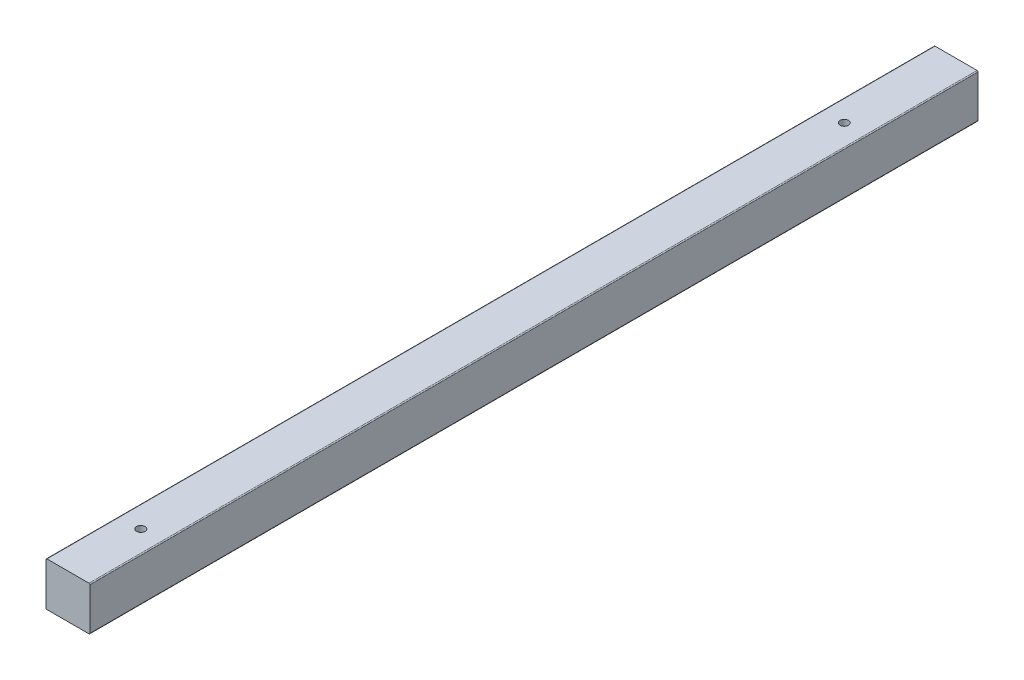
ISO-10303-21;
HEADER;
FILE_DESCRIPTION(('STEP AP214'),'2;1');
FILE_NAME('part.step','',(''),(''),'','','');
FILE_SCHEMA(('AUTOMOTIVE_DESIGN { 1 0 10303 214 1 1 1 1 }'));
ENDSEC;
DATA;
#1=APPLICATION_CONTEXT('core data for automotive mechanical design processes');
#2=APPLICATION_PROTOCOL_DEFINITION('international standard','automotive_design',2000,#1);
#3=PRODUCT_CONTEXT('',#1,'mechanical');
#4=PRODUCT('Part','Part','',(#3));
#5=PRODUCT_RELATED_PRODUCT_CATEGORY('part','',(#4));
#6=PRODUCT_DEFINITION_FORMATION('','',#4);
#7=PRODUCT_DEFINITION_CONTEXT('part definition',#1,'design');
#8=PRODUCT_DEFINITION('design','',#6,#7);
#9=PRODUCT_DEFINITION_SHAPE('','',#8);
#10=(LENGTH_UNIT() NAMED_UNIT(*) SI_UNIT(.MILLI.,.METRE.));
#11=(NAMED_UNIT(*) PLANE_ANGLE_UNIT() SI_UNIT($,.RADIAN.));
#12=(NAMED_UNIT(*) SI_UNIT($,.STERADIAN.) SOLID_ANGLE_UNIT());
#13=UNCERTAINTY_MEASURE_WITH_UNIT(LENGTH_MEASURE(1.E-05),#10,'distance_accuracy_value','');
#14=(GEOMETRIC_REPRESENTATION_CONTEXT(3) GLOBAL_UNCERTAINTY_ASSIGNED_CONTEXT((#13)) GLOBAL_UNIT_ASSIGNED_CONTEXT((#10,
#11,#12)) REPRESENTATION_CONTEXT('',''));
#15=CARTESIAN_POINT('',(0.,0.,0.));
#16=DIRECTION('',(0.,0.,1.));
#17=DIRECTION('',(1.,0.,0.));
#18=AXIS2_PLACEMENT_3D('',#15,#16,#17);
#19=CARTESIAN_POINT('',(0.,0.,890.));
#20=DIRECTION('',(-1.,0.,0.));
#21=DIRECTION('',(0.,0.,1.));
#22=AXIS2_PLACEMENT_3D('',#19,#20,#21);
#23=PLANE('',#22);
#24=DIRECTION('',(0.,1.,0.));
#25=VECTOR('',#24,1.);
#26=CARTESIAN_POINT('',(0.,0.,0.));
#27=LINE('',#26,#25);
#28=CARTESIAN_POINT('',(0.,1.,0.));
#29=VERTEX_POINT('',#28);
#30=CARTESIAN_POINT('',(0.,43.,0.));
#31=VERTEX_POINT('',#30);
#32=EDGE_CURVE('E136',#29,#31,#27,.T.);
#33=ORIENTED_EDGE('',*,*,#32,.T.);
#34=DIRECTION('',(0.,0.,-1.));
#35=VECTOR('',#34,1.);
#36=CARTESIAN_POINT('',(0.,43.,890.));
#37=LINE('',#36,#35);
#38=CARTESIAN_POINT('',(0.,43.,890.));
#39=VERTEX_POINT('',#38);
#40=EDGE_CURVE('E158',#31,#39,#37,.F.);
#41=ORIENTED_EDGE('',*,*,#40,.T.);
#42=DIRECTION('',(0.,1.,0.));
#43=VECTOR('',#42,1.);
#44=CARTESIAN_POINT('',(0.,0.,890.));
#45=LINE('',#44,#43);
#46=CARTESIAN_POINT('',(0.,1.,890.));
#47=VERTEX_POINT('',#46);
#48=EDGE_CURVE('E134',#47,#39,#45,.T.);
#49=ORIENTED_EDGE('',*,*,#48,.F.);
#50=DIRECTION('',(0.,0.,-1.));
#51=VECTOR('',#50,1.);
#52=CARTESIAN_POINT('',(0.,1.,890.));
#53=LINE('',#52,#51);
#54=EDGE_CURVE('E155',#47,#29,#53,.T.);
#55=ORIENTED_EDGE('',*,*,#54,.T.);
#56=EDGE_LOOP('',(#33,#41,#49,#55));
#57=FACE_BOUND('',#56,.T.);
#58=ADVANCED_FACE('F39',(#57),#23,.F.);
#59=CARTESIAN_POINT('',(0.,44.,890.));
#60=DIRECTION('',(0.,-1.,0.));
#61=DIRECTION('',(1.,0.,0.));
#62=AXIS2_PLACEMENT_3D('',#59,#60,#61);
#63=PLANE('',#62);
#64=CARTESIAN_POINT('',(-22.,44.,817.));
#65=DIRECTION('',(0.,-1.,0.));
#66=DIRECTION('',(1.,0.,0.));
#67=AXIS2_PLACEMENT_3D('',#64,#65,#66);
#68=CIRCLE('',#67,4.24999999999999);
#69=CARTESIAN_POINT('',(-17.75,44.,817.));
#70=VERTEX_POINT('',#69);
#71=EDGE_CURVE('E190',#70,#70,#68,.T.);
#72=ORIENTED_EDGE('',*,*,#71,.T.);
#73=EDGE_LOOP('',(#72));
#74=FACE_BOUND('',#73,.T.);
#75=CARTESIAN_POINT('',(-22.,44.,112.));
#76=DIRECTION('',(0.,-1.,0.));
#77=DIRECTION('',(1.,0.,0.));
#78=AXIS2_PLACEMENT_3D('',#75,#76,#77);
#79=CIRCLE('',#78,4.25);
#80=CARTESIAN_POINT('',(-17.75,44.,112.));
#81=VERTEX_POINT('',#80);
#82=EDGE_CURVE('E198',#81,#81,#79,.T.);
#83=ORIENTED_EDGE('',*,*,#82,.T.);
#84=EDGE_LOOP('',(#83));
#85=FACE_BOUND('',#84,.T.);
#86=DIRECTION('',(-1.,0.,0.));
#87=VECTOR('',#86,1.);
#88=CARTESIAN_POINT('',(0.,44.,0.));
#89=LINE('',#88,#87);
#90=CARTESIAN_POINT('',(-1.,44.,0.));
#91=VERTEX_POINT('',#90);
#92=CARTESIAN_POINT('',(-43.,44.,0.));
#93=VERTEX_POINT('',#92);
#94=EDGE_CURVE('E132',#91,#93,#89,.T.);
#95=ORIENTED_EDGE('',*,*,#94,.T.);
#96=DIRECTION('',(0.,0.,-1.));
#97=VECTOR('',#96,1.);
#98=CARTESIAN_POINT('',(-43.,44.,890.));
#99=LINE('',#98,#97);
#100=CARTESIAN_POINT('',(-43.,44.,890.));
#101=VERTEX_POINT('',#100);
#102=EDGE_CURVE('E110',#93,#101,#99,.F.);
#103=ORIENTED_EDGE('',*,*,#102,.T.);
#104=DIRECTION('',(-1.,0.,0.));
#105=VECTOR('',#104,1.);
#106=CARTESIAN_POINT('',(0.,44.,890.));
#107=LINE('',#106,#105);
#108=CARTESIAN_POINT('',(-1.,44.,890.));
#109=VERTEX_POINT('',#108);
#110=EDGE_CURVE('E172',#109,#101,#107,.T.);
#111=ORIENTED_EDGE('',*,*,#110,.F.);
#112=DIRECTION('',(0.,0.,-1.));
#113=VECTOR('',#112,1.);
#114=CARTESIAN_POINT('',(-1.,44.,890.));
#115=LINE('',#114,#113);
#116=EDGE_CURVE('E115',#109,#91,#115,.T.);
#117=ORIENTED_EDGE('',*,*,#116,.T.);
#118=EDGE_LOOP('',(#95,#103,#111,#117));
#119=FACE_BOUND('',#118,.T.);
#120=ADVANCED_FACE('F177',(#74,#85,#119),#63,.F.);
#121=CARTESIAN_POINT('',(-44.,0.,890.));
#122=DIRECTION('',(1.,0.,0.));
#123=DIRECTION('',(0.,0.,-1.));
#124=AXIS2_PLACEMENT_3D('',#121,#122,#123);
#125=PLANE('',#124);
#126=DIRECTION('',(0.,-1.,0.));
#127=VECTOR('',#126,1.);
#128=CARTESIAN_POINT('',(-44.,0.,890.));
#129=LINE('',#128,#127);
#130=CARTESIAN_POINT('',(-44.,43.,890.));
#131=VERTEX_POINT('',#130);
#132=CARTESIAN_POINT('',(-44.,0.999999999999995,890.));
#133=VERTEX_POINT('',#132);
#134=EDGE_CURVE('E124',#131,#133,#129,.T.);
#135=ORIENTED_EDGE('',*,*,#134,.F.);
#136=DIRECTION('',(0.,0.,-1.));
#137=VECTOR('',#136,1.);
#138=CARTESIAN_POINT('',(-44.,43.,890.));
#139=LINE('',#138,#137);
#140=CARTESIAN_POINT('',(-44.,43.,0.));
#141=VERTEX_POINT('',#140);
#142=EDGE_CURVE('E109',#131,#141,#139,.T.);
#143=ORIENTED_EDGE('',*,*,#142,.T.);
#144=DIRECTION('',(0.,-1.,0.));
#145=VECTOR('',#144,1.);
#146=CARTESIAN_POINT('',(-44.,0.,0.));
#147=LINE('',#146,#145);
#148=CARTESIAN_POINT('',(-44.,0.999999999999995,0.));
#149=VERTEX_POINT('',#148);
#150=EDGE_CURVE('E122',#141,#149,#147,.T.);
#151=ORIENTED_EDGE('',*,*,#150,.T.);
#152=DIRECTION('',(0.,0.,-1.));
#153=VECTOR('',#152,1.);
#154=CARTESIAN_POINT('',(-44.,0.999999999999995,890.));
#155=LINE('',#154,#153);
#156=EDGE_CURVE('E126',#149,#133,#155,.F.);
#157=ORIENTED_EDGE('',*,*,#156,.T.);
#158=EDGE_LOOP('',(#135,#143,#151,#157));
#159=FACE_BOUND('',#158,.T.);
#160=ADVANCED_FACE('F121',(#159),#125,.F.);
#161=CARTESIAN_POINT('',(0.,0.,890.));
#162=DIRECTION('',(0.,1.,0.));
#163=DIRECTION('',(-1.,0.,0.));
#164=AXIS2_PLACEMENT_3D('',#161,#162,#163);
#165=PLANE('',#164);
#166=CARTESIAN_POINT('',(-22.,0.,817.));
#167=DIRECTION('',(0.,-1.,0.));
#168=DIRECTION('',(1.,0.,0.));
#169=AXIS2_PLACEMENT_3D('',#166,#167,#168);
#170=CIRCLE('',#169,14.);
#171=CARTESIAN_POINT('',(-8.,0.,817.));
#172=VERTEX_POINT('',#171);
#173=EDGE_CURVE('E180',#172,#172,#170,.T.);
#174=ORIENTED_EDGE('',*,*,#173,.F.);
#175=EDGE_LOOP('',(#174));
#176=FACE_BOUND('',#175,.T.);
#177=CARTESIAN_POINT('',(-22.,0.,112.));
#178=DIRECTION('',(0.,-1.,0.));
#179=DIRECTION('',(1.,0.,0.));
#180=AXIS2_PLACEMENT_3D('',#177,#178,#179);
#181=CIRCLE('',#180,14.);
#182=CARTESIAN_POINT('',(-8.,0.,112.));
#183=VERTEX_POINT('',#182);
#184=EDGE_CURVE('E186',#183,#183,#181,.T.);
#185=ORIENTED_EDGE('',*,*,#184,.F.);
#186=EDGE_LOOP('',(#185));
#187=FACE_BOUND('',#186,.T.);
#188=DIRECTION('',(1.,0.,0.));
#189=VECTOR('',#188,1.);
#190=CARTESIAN_POINT('',(0.,0.,890.));
#191=LINE('',#190,#189);
#192=CARTESIAN_POINT('',(-43.,0.,890.));
#193=VERTEX_POINT('',#192);
#194=CARTESIAN_POINT('',(-1.,0.,890.));
#195=VERTEX_POINT('',#194);
#196=EDGE_CURVE('E140',#193,#195,#191,.T.);
#197=ORIENTED_EDGE('',*,*,#196,.F.);
#198=DIRECTION('',(0.,0.,-1.));
#199=VECTOR('',#198,1.);
#200=CARTESIAN_POINT('',(-43.,0.,890.));
#201=LINE('',#200,#199);
#202=CARTESIAN_POINT('',(-43.,0.,0.));
#203=VERTEX_POINT('',#202);
#204=EDGE_CURVE('E11',#193,#203,#201,.T.);
#205=ORIENTED_EDGE('',*,*,#204,.T.);
#206=DIRECTION('',(1.,0.,0.));
#207=VECTOR('',#206,1.);
#208=CARTESIAN_POINT('',(0.,0.,0.));
#209=LINE('',#208,#207);
#210=CARTESIAN_POINT('',(-1.,0.,0.));
#211=VERTEX_POINT('',#210);
#212=EDGE_CURVE('E131',#203,#211,#209,.T.);
#213=ORIENTED_EDGE('',*,*,#212,.T.);
#214=DIRECTION('',(0.,0.,-1.));
#215=VECTOR('',#214,1.);
#216=CARTESIAN_POINT('',(-1.,0.,890.));
#217=LINE('',#216,#215);
#218=EDGE_CURVE('E47',#211,#195,#217,.F.);
#219=ORIENTED_EDGE('',*,*,#218,.T.);
#220=EDGE_LOOP('',(#197,#205,#213,#219));
#221=FACE_BOUND('',#220,.T.);
#222=ADVANCED_FACE('F229',(#176,#187,#221),#165,.F.);
#223=CARTESIAN_POINT('',(0.,0.,890.));
#224=DIRECTION('',(0.,0.,1.));
#225=DIRECTION('',(1.,0.,0.));
#226=AXIS2_PLACEMENT_3D('',#223,#224,#225);
#227=PLANE('',#226);
#228=ORIENTED_EDGE('',*,*,#110,.T.);
#229=CARTESIAN_POINT('',(-43.,43.,890.));
#230=DIRECTION('',(0.,0.,1.));
#231=DIRECTION('',(1.,0.,0.));
#232=AXIS2_PLACEMENT_3D('',#229,#230,#231);
#233=CIRCLE('',#232,1.);
#234=EDGE_CURVE('E153',#101,#131,#233,.T.);
#235=ORIENTED_EDGE('',*,*,#234,.T.);
#236=ORIENTED_EDGE('',*,*,#134,.T.);
#237=CARTESIAN_POINT('',(-43.,0.999999999999995,890.));
#238=DIRECTION('',(0.,0.,1.));
#239=DIRECTION('',(1.,0.,0.));
#240=AXIS2_PLACEMENT_3D('',#237,#238,#239);
#241=CIRCLE('',#240,1.);
#242=EDGE_CURVE('E60',#133,#193,#241,.T.);
#243=ORIENTED_EDGE('',*,*,#242,.T.);
#244=ORIENTED_EDGE('',*,*,#196,.T.);
#245=CARTESIAN_POINT('',(-1.,1.,890.));
#246=DIRECTION('',(0.,0.,1.));
#247=DIRECTION('',(1.,0.,0.));
#248=AXIS2_PLACEMENT_3D('',#245,#246,#247);
#249=CIRCLE('',#248,1.);
#250=EDGE_CURVE('E148',#195,#47,#249,.T.);
#251=ORIENTED_EDGE('',*,*,#250,.T.);
#252=ORIENTED_EDGE('',*,*,#48,.T.);
#253=CARTESIAN_POINT('',(-1.,43.,890.));
#254=DIRECTION('',(0.,0.,1.));
#255=DIRECTION('',(1.,0.,0.));
#256=AXIS2_PLACEMENT_3D('',#253,#254,#255);
#257=CIRCLE('',#256,1.);
#258=EDGE_CURVE('E151',#39,#109,#257,.T.);
#259=ORIENTED_EDGE('',*,*,#258,.T.);
#260=EDGE_LOOP('',(#228,#235,#236,#243,#244,#251,#252,#259));
#261=FACE_BOUND('',#260,.T.);
#262=ADVANCED_FACE('F169',(#261),#227,.T.);
#263=CARTESIAN_POINT('',(0.,0.,0.));
#264=DIRECTION('',(0.,0.,1.));
#265=DIRECTION('',(1.,0.,0.));
#266=AXIS2_PLACEMENT_3D('',#263,#264,#265);
#267=PLANE('',#266);
#268=ORIENTED_EDGE('',*,*,#150,.F.);
#269=CARTESIAN_POINT('',(-43.,43.,0.));
#270=DIRECTION('',(0.,0.,1.));
#271=DIRECTION('',(1.,0.,0.));
#272=AXIS2_PLACEMENT_3D('',#269,#270,#271);
#273=CIRCLE('',#272,1.);
#274=EDGE_CURVE('E105',#141,#93,#273,.F.);
#275=ORIENTED_EDGE('',*,*,#274,.T.);
#276=ORIENTED_EDGE('',*,*,#94,.F.);
#277=CARTESIAN_POINT('',(-1.,43.,0.));
#278=DIRECTION('',(0.,0.,1.));
#279=DIRECTION('',(1.,0.,0.));
#280=AXIS2_PLACEMENT_3D('',#277,#278,#279);
#281=CIRCLE('',#280,1.);
#282=EDGE_CURVE('E116',#91,#31,#281,.F.);
#283=ORIENTED_EDGE('',*,*,#282,.T.);
#284=ORIENTED_EDGE('',*,*,#32,.F.);
#285=CARTESIAN_POINT('',(-1.,1.,0.));
#286=DIRECTION('',(0.,0.,1.));
#287=DIRECTION('',(1.,0.,0.));
#288=AXIS2_PLACEMENT_3D('',#285,#286,#287);
#289=CIRCLE('',#288,1.);
#290=EDGE_CURVE('E125',#29,#211,#289,.F.);
#291=ORIENTED_EDGE('',*,*,#290,.T.);
#292=ORIENTED_EDGE('',*,*,#212,.F.);
#293=CARTESIAN_POINT('',(-43.,0.999999999999995,0.));
#294=DIRECTION('',(0.,0.,1.));
#295=DIRECTION('',(1.,0.,0.));
#296=AXIS2_PLACEMENT_3D('',#293,#294,#295);
#297=CIRCLE('',#296,1.);
#298=EDGE_CURVE('E130',#203,#149,#297,.F.);
#299=ORIENTED_EDGE('',*,*,#298,.T.);
#300=EDGE_LOOP('',(#268,#275,#276,#283,#284,#291,#292,#299));
#301=FACE_BOUND('',#300,.T.);
#302=ADVANCED_FACE('F128',(#301),#267,.F.);
#303=CARTESIAN_POINT('',(-43.,43.,890.));
#304=DIRECTION('',(0.,0.,-1.));
#305=DIRECTION('',(-1.,0.,0.));
#306=AXIS2_PLACEMENT_3D('',#303,#304,#305);
#307=CYLINDRICAL_SURFACE('',#306,1.);
#308=ORIENTED_EDGE('',*,*,#234,.F.);
#309=ORIENTED_EDGE('',*,*,#102,.F.);
#310=ORIENTED_EDGE('',*,*,#274,.F.);
#311=ORIENTED_EDGE('',*,*,#142,.F.);
#312=EDGE_LOOP('',(#308,#309,#310,#311));
#313=FACE_BOUND('',#312,.T.);
#314=ADVANCED_FACE('F108',(#313),#307,.T.);
#315=CARTESIAN_POINT('',(-1.,43.,890.));
#316=DIRECTION('',(0.,0.,-1.));
#317=DIRECTION('',(-1.,0.,0.));
#318=AXIS2_PLACEMENT_3D('',#315,#316,#317);
#319=CYLINDRICAL_SURFACE('',#318,1.);
#320=ORIENTED_EDGE('',*,*,#258,.F.);
#321=ORIENTED_EDGE('',*,*,#40,.F.);
#322=ORIENTED_EDGE('',*,*,#282,.F.);
#323=ORIENTED_EDGE('',*,*,#116,.F.);
#324=EDGE_LOOP('',(#320,#321,#322,#323));
#325=FACE_BOUND('',#324,.T.);
#326=ADVANCED_FACE('F175',(#325),#319,.T.);
#327=CARTESIAN_POINT('',(-43.,0.999999999999995,890.));
#328=DIRECTION('',(0.,0.,-1.));
#329=DIRECTION('',(-1.,0.,0.));
#330=AXIS2_PLACEMENT_3D('',#327,#328,#329);
#331=CYLINDRICAL_SURFACE('',#330,1.);
#332=ORIENTED_EDGE('',*,*,#242,.F.);
#333=ORIENTED_EDGE('',*,*,#156,.F.);
#334=ORIENTED_EDGE('',*,*,#298,.F.);
#335=ORIENTED_EDGE('',*,*,#204,.F.);
#336=EDGE_LOOP('',(#332,#333,#334,#335));
#337=FACE_BOUND('',#336,.T.);
#338=ADVANCED_FACE('F236',(#337),#331,.T.);
#339=CARTESIAN_POINT('',(-1.,1.,890.));
#340=DIRECTION('',(0.,0.,-1.));
#341=DIRECTION('',(-1.,0.,0.));
#342=AXIS2_PLACEMENT_3D('',#339,#340,#341);
#343=CYLINDRICAL_SURFACE('',#342,1.);
#344=ORIENTED_EDGE('',*,*,#250,.F.);
#345=ORIENTED_EDGE('',*,*,#218,.F.);
#346=ORIENTED_EDGE('',*,*,#290,.F.);
#347=ORIENTED_EDGE('',*,*,#54,.F.);
#348=EDGE_LOOP('',(#344,#345,#346,#347));
#349=FACE_BOUND('',#348,.T.);
#350=ADVANCED_FACE('F41',(#349),#343,.T.);
#351=CARTESIAN_POINT('',(-22.,8.,112.));
#352=DIRECTION('',(0.,-1.,0.));
#353=DIRECTION('',(1.,0.,0.));
#354=AXIS2_PLACEMENT_3D('',#351,#352,#353);
#355=CYLINDRICAL_SURFACE('',#354,14.);
#356=CARTESIAN_POINT('',(-22.,8.,112.));
#357=DIRECTION('',(0.,-1.,0.));
#358=DIRECTION('',(1.,0.,0.));
#359=AXIS2_PLACEMENT_3D('',#356,#357,#358);
#360=CIRCLE('',#359,14.);
#361=CARTESIAN_POINT('',(-8.,8.,112.));
#362=VERTEX_POINT('',#361);
#363=EDGE_CURVE('E189',#362,#362,#360,.T.);
#364=ORIENTED_EDGE('',*,*,#363,.F.);
#365=EDGE_LOOP('',(#364));
#366=FACE_BOUND('',#365,.T.);
#367=ORIENTED_EDGE('',*,*,#184,.T.);
#368=EDGE_LOOP('',(#367));
#369=FACE_BOUND('',#368,.T.);
#370=ADVANCED_FACE('F242',(#366,#369),#355,.F.);
#371=CARTESIAN_POINT('',(-22.,8.,112.));
#372=DIRECTION('',(0.,-1.,0.));
#373=DIRECTION('',(1.,0.,0.));
#374=AXIS2_PLACEMENT_3D('',#371,#372,#373);
#375=PLANE('',#374);
#376=CARTESIAN_POINT('',(-22.,8.,112.));
#377=DIRECTION('',(0.,-1.,0.));
#378=DIRECTION('',(1.,0.,0.));
#379=AXIS2_PLACEMENT_3D('',#376,#377,#378);
#380=CIRCLE('',#379,4.25);
#381=CARTESIAN_POINT('',(-17.75,8.,112.));
#382=VERTEX_POINT('',#381);
#383=EDGE_CURVE('E195',#382,#382,#380,.T.);
#384=ORIENTED_EDGE('',*,*,#383,.F.);
#385=EDGE_LOOP('',(#384));
#386=FACE_BOUND('',#385,.T.);
#387=ORIENTED_EDGE('',*,*,#363,.T.);
#388=EDGE_LOOP('',(#387));
#389=FACE_BOUND('',#388,.T.);
#390=ADVANCED_FACE('F225',(#386,#389),#375,.T.);
#391=CARTESIAN_POINT('',(-22.,8.,817.));
#392=DIRECTION('',(0.,-1.,0.));
#393=DIRECTION('',(1.,0.,0.));
#394=AXIS2_PLACEMENT_3D('',#391,#392,#393);
#395=CYLINDRICAL_SURFACE('',#394,14.);
#396=CARTESIAN_POINT('',(-22.,8.,817.));
#397=DIRECTION('',(0.,-1.,0.));
#398=DIRECTION('',(1.,0.,0.));
#399=AXIS2_PLACEMENT_3D('',#396,#397,#398);
#400=CIRCLE('',#399,14.);
#401=CARTESIAN_POINT('',(-8.,8.,817.));
#402=VERTEX_POINT('',#401);
#403=EDGE_CURVE('E178',#402,#402,#400,.T.);
#404=ORIENTED_EDGE('',*,*,#403,.F.);
#405=EDGE_LOOP('',(#404));
#406=FACE_BOUND('',#405,.T.);
#407=ORIENTED_EDGE('',*,*,#173,.T.);
#408=EDGE_LOOP('',(#407));
#409=FACE_BOUND('',#408,.T.);
#410=ADVANCED_FACE('F219',(#406,#409),#395,.F.);
#411=CARTESIAN_POINT('',(-22.,8.,817.));
#412=DIRECTION('',(0.,-1.,0.));
#413=DIRECTION('',(1.,0.,0.));
#414=AXIS2_PLACEMENT_3D('',#411,#412,#413);
#415=PLANE('',#414);
#416=CARTESIAN_POINT('',(-22.,8.,817.));
#417=DIRECTION('',(0.,-1.,0.));
#418=DIRECTION('',(1.,0.,0.));
#419=AXIS2_PLACEMENT_3D('',#416,#417,#418);
#420=CIRCLE('',#419,4.24999999999999);
#421=CARTESIAN_POINT('',(-17.75,8.,817.));
#422=VERTEX_POINT('',#421);
#423=EDGE_CURVE('E201',#422,#422,#420,.T.);
#424=ORIENTED_EDGE('',*,*,#423,.F.);
#425=EDGE_LOOP('',(#424));
#426=FACE_BOUND('',#425,.T.);
#427=ORIENTED_EDGE('',*,*,#403,.T.);
#428=EDGE_LOOP('',(#427));
#429=FACE_BOUND('',#428,.T.);
#430=ADVANCED_FACE('F216',(#426,#429),#415,.T.);
#431=CARTESIAN_POINT('',(-22.,44.,112.));
#432=DIRECTION('',(0.,-1.,0.));
#433=DIRECTION('',(1.,0.,0.));
#434=AXIS2_PLACEMENT_3D('',#431,#432,#433);
#435=CYLINDRICAL_SURFACE('',#434,4.25);
#436=ORIENTED_EDGE('',*,*,#82,.F.);
#437=EDGE_LOOP('',(#436));
#438=FACE_BOUND('',#437,.T.);
#439=ORIENTED_EDGE('',*,*,#383,.T.);
#440=EDGE_LOOP('',(#439));
#441=FACE_BOUND('',#440,.T.);
#442=ADVANCED_FACE('F212',(#438,#441),#435,.F.);
#443=CARTESIAN_POINT('',(-22.,44.,817.));
#444=DIRECTION('',(0.,-1.,0.));
#445=DIRECTION('',(1.,0.,0.));
#446=AXIS2_PLACEMENT_3D('',#443,#444,#445);
#447=CYLINDRICAL_SURFACE('',#446,4.24999999999999);
#448=ORIENTED_EDGE('',*,*,#71,.F.);
#449=EDGE_LOOP('',(#448));
#450=FACE_BOUND('',#449,.T.);
#451=ORIENTED_EDGE('',*,*,#423,.T.);
#452=EDGE_LOOP('',(#451));
#453=FACE_BOUND('',#452,.T.);
#454=ADVANCED_FACE('F209',(#450,#453),#447,.F.);
#455=CLOSED_SHELL('',(#58,#120,#160,#222,#262,#302,#314,#326,#338,#350,#370,#390,#410,#430,#442,#454));
#456=MANIFOLD_SOLID_BREP('B2',#455);
#457=ADVANCED_BREP_SHAPE_REPRESENTATION('',(#18,#456),#14);
#458=SHAPE_DEFINITION_REPRESENTATION(#9,#457);
ENDSEC;
END-ISO-10303-21;
